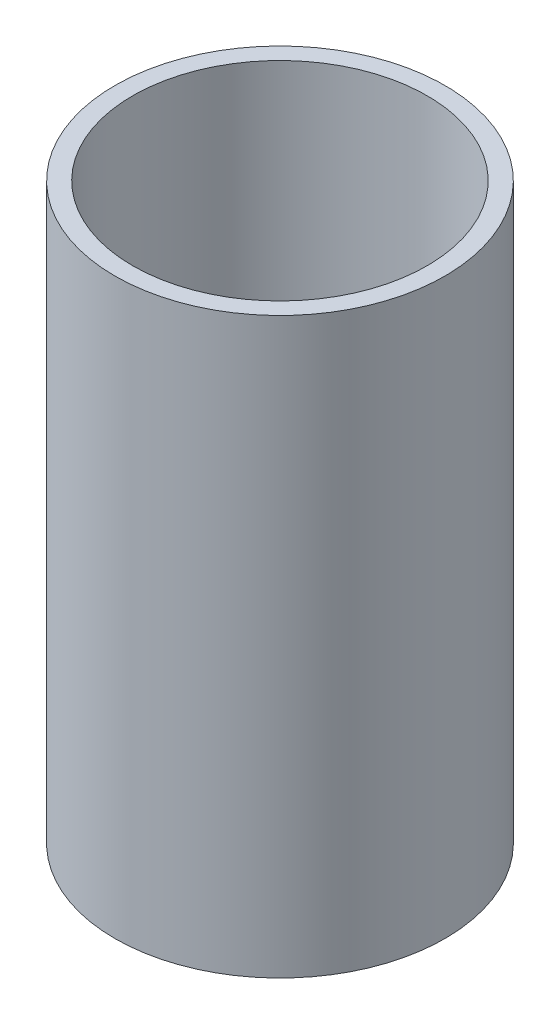
ISO-10303-21;
HEADER;
FILE_DESCRIPTION(('STEP AP214'),'2;1');
FILE_NAME('part.step','',(''),(''),'','','');
FILE_SCHEMA(('AUTOMOTIVE_DESIGN { 1 0 10303 214 1 1 1 1 }'));
ENDSEC;
DATA;
#1=APPLICATION_CONTEXT('core data for automotive mechanical design processes');
#2=APPLICATION_PROTOCOL_DEFINITION('international standard','automotive_design',2000,#1);
#3=PRODUCT_CONTEXT('',#1,'mechanical');
#4=PRODUCT('Part','Part','',(#3));
#5=PRODUCT_RELATED_PRODUCT_CATEGORY('part','',(#4));
#6=PRODUCT_DEFINITION_FORMATION('','',#4);
#7=PRODUCT_DEFINITION_CONTEXT('part definition',#1,'design');
#8=PRODUCT_DEFINITION('design','',#6,#7);
#9=PRODUCT_DEFINITION_SHAPE('','',#8);
#10=(LENGTH_UNIT() NAMED_UNIT(*) SI_UNIT(.MILLI.,.METRE.));
#11=(NAMED_UNIT(*) PLANE_ANGLE_UNIT() SI_UNIT($,.RADIAN.));
#12=(NAMED_UNIT(*) SI_UNIT($,.STERADIAN.) SOLID_ANGLE_UNIT());
#13=UNCERTAINTY_MEASURE_WITH_UNIT(LENGTH_MEASURE(1.E-05),#10,'distance_accuracy_value','');
#14=(GEOMETRIC_REPRESENTATION_CONTEXT(3) GLOBAL_UNCERTAINTY_ASSIGNED_CONTEXT((#13)) GLOBAL_UNIT_ASSIGNED_CONTEXT((#10,
#11,#12)) REPRESENTATION_CONTEXT('',''));
#15=CARTESIAN_POINT('',(0.,0.,0.));
#16=DIRECTION('',(0.,0.,1.));
#17=DIRECTION('',(1.,0.,0.));
#18=AXIS2_PLACEMENT_3D('',#15,#16,#17);
#19=CARTESIAN_POINT('',(0.,147.763626695804,0.));
#20=DIRECTION('',(0.,-1.,0.));
#21=DIRECTION('',(0.,0.,-1.));
#22=AXIS2_PLACEMENT_3D('',#19,#20,#21);
#23=CYLINDRICAL_SURFACE('',#22,42.5);
#24=CARTESIAN_POINT('',(0.,147.763626695804,0.));
#25=DIRECTION('',(0.,1.,0.));
#26=DIRECTION('',(0.,0.,1.));
#27=AXIS2_PLACEMENT_3D('',#24,#25,#26);
#28=CIRCLE('',#27,42.5);
#29=CARTESIAN_POINT('',(0.,147.763626695804,42.5));
#30=VERTEX_POINT('',#29);
#31=EDGE_CURVE('E10',#30,#30,#28,.T.);
#32=ORIENTED_EDGE('',*,*,#31,.F.);
#33=EDGE_LOOP('',(#32));
#34=FACE_BOUND('',#33,.T.);
#35=CARTESIAN_POINT('',(0.,0.,0.));
#36=DIRECTION('',(0.,1.,0.));
#37=DIRECTION('',(0.,0.,1.));
#38=AXIS2_PLACEMENT_3D('',#35,#36,#37);
#39=CIRCLE('',#38,42.5);
#40=CARTESIAN_POINT('',(0.,0.,42.5));
#41=VERTEX_POINT('',#40);
#42=EDGE_CURVE('E37',#41,#41,#39,.T.);
#43=ORIENTED_EDGE('',*,*,#42,.T.);
#44=EDGE_LOOP('',(#43));
#45=FACE_BOUND('',#44,.T.);
#46=ADVANCED_FACE('F40',(#34,#45),#23,.T.);
#47=CARTESIAN_POINT('',(0.,147.763626695804,0.));
#48=DIRECTION('',(0.,1.,0.));
#49=DIRECTION('',(0.,0.,1.));
#50=AXIS2_PLACEMENT_3D('',#47,#48,#49);
#51=PLANE('',#50);
#52=CARTESIAN_POINT('',(0.,147.763626695804,0.));
#53=DIRECTION('',(0.,1.,0.));
#54=DIRECTION('',(0.,0.,1.));
#55=AXIS2_PLACEMENT_3D('',#52,#53,#54);
#56=CIRCLE('',#55,37.9231736444099);
#57=CARTESIAN_POINT('',(0.,147.763626695804,37.9231736444099));
#58=VERTEX_POINT('',#57);
#59=EDGE_CURVE('E50',#58,#58,#56,.T.);
#60=ORIENTED_EDGE('',*,*,#59,.F.);
#61=EDGE_LOOP('',(#60));
#62=FACE_BOUND('',#61,.T.);
#63=ORIENTED_EDGE('',*,*,#31,.T.);
#64=EDGE_LOOP('',(#63));
#65=FACE_BOUND('',#64,.T.);
#66=ADVANCED_FACE('F59',(#62,#65),#51,.T.);
#67=CARTESIAN_POINT('',(0.,0.,0.));
#68=DIRECTION('',(0.,1.,0.));
#69=DIRECTION('',(0.,0.,1.));
#70=AXIS2_PLACEMENT_3D('',#67,#68,#69);
#71=PLANE('',#70);
#72=CARTESIAN_POINT('',(0.,0.,0.));
#73=DIRECTION('',(0.,1.,0.));
#74=DIRECTION('',(0.,0.,1.));
#75=AXIS2_PLACEMENT_3D('',#72,#73,#74);
#76=CIRCLE('',#75,37.9231736444099);
#77=CARTESIAN_POINT('',(0.,0.,37.9231736444099));
#78=VERTEX_POINT('',#77);
#79=EDGE_CURVE('E47',#78,#78,#76,.T.);
#80=ORIENTED_EDGE('',*,*,#79,.T.);
#81=EDGE_LOOP('',(#80));
#82=FACE_BOUND('',#81,.T.);
#83=ORIENTED_EDGE('',*,*,#42,.F.);
#84=EDGE_LOOP('',(#83));
#85=FACE_BOUND('',#84,.T.);
#86=ADVANCED_FACE('F58',(#82,#85),#71,.F.);
#87=CARTESIAN_POINT('',(0.,147.763626695804,0.));
#88=DIRECTION('',(0.,-1.,0.));
#89=DIRECTION('',(0.,0.,-1.));
#90=AXIS2_PLACEMENT_3D('',#87,#88,#89);
#91=CYLINDRICAL_SURFACE('',#90,37.9231736444099);
#92=ORIENTED_EDGE('',*,*,#59,.T.);
#93=EDGE_LOOP('',(#92));
#94=FACE_BOUND('',#93,.T.);
#95=ORIENTED_EDGE('',*,*,#79,.F.);
#96=EDGE_LOOP('',(#95));
#97=FACE_BOUND('',#96,.T.);
#98=ADVANCED_FACE('F54',(#94,#97),#91,.F.);
#99=CLOSED_SHELL('',(#46,#66,#86,#98));
#100=MANIFOLD_SOLID_BREP('B2',#99);
#101=ADVANCED_BREP_SHAPE_REPRESENTATION('',(#18,#100),#14);
#102=SHAPE_DEFINITION_REPRESENTATION(#9,#101);
ENDSEC;
END-ISO-10303-21;
